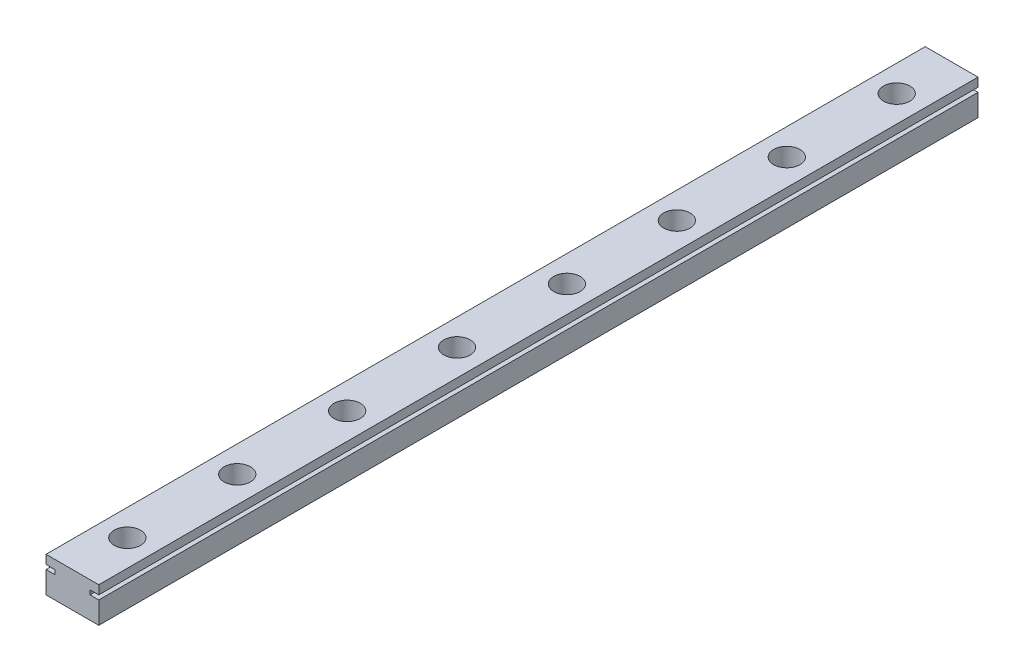
ISO-10303-21;
HEADER;
FILE_DESCRIPTION(('STEP AP214'),'2;1');
FILE_NAME('part.step','',(''),(''),'','','');
FILE_SCHEMA(('AUTOMOTIVE_DESIGN { 1 0 10303 214 1 1 1 1 }'));
ENDSEC;
DATA;
#1=APPLICATION_CONTEXT('core data for automotive mechanical design processes');
#2=APPLICATION_PROTOCOL_DEFINITION('international standard','automotive_design',2000,#1);
#3=PRODUCT_CONTEXT('',#1,'mechanical');
#4=PRODUCT('Part','Part','',(#3));
#5=PRODUCT_RELATED_PRODUCT_CATEGORY('part','',(#4));
#6=PRODUCT_DEFINITION_FORMATION('','',#4);
#7=PRODUCT_DEFINITION_CONTEXT('part definition',#1,'design');
#8=PRODUCT_DEFINITION('design','',#6,#7);
#9=PRODUCT_DEFINITION_SHAPE('','',#8);
#10=(LENGTH_UNIT() NAMED_UNIT(*) SI_UNIT(.MILLI.,.METRE.));
#11=(NAMED_UNIT(*) PLANE_ANGLE_UNIT() SI_UNIT($,.RADIAN.));
#12=(NAMED_UNIT(*) SI_UNIT($,.STERADIAN.) SOLID_ANGLE_UNIT());
#13=UNCERTAINTY_MEASURE_WITH_UNIT(LENGTH_MEASURE(1.E-05),#10,'distance_accuracy_value','');
#14=(GEOMETRIC_REPRESENTATION_CONTEXT(3) GLOBAL_UNCERTAINTY_ASSIGNED_CONTEXT((#13)) GLOBAL_UNIT_ASSIGNED_CONTEXT((#10,
#11,#12)) REPRESENTATION_CONTEXT('',''));
#15=CARTESIAN_POINT('',(0.,0.,0.));
#16=DIRECTION('',(0.,0.,1.));
#17=DIRECTION('',(1.,0.,0.));
#18=AXIS2_PLACEMENT_3D('',#15,#16,#17);
#19=CARTESIAN_POINT('',(-6.,4.,100.));
#20=DIRECTION('',(0.,-1.,0.));
#21=DIRECTION('',(0.,0.,-1.));
#22=AXIS2_PLACEMENT_3D('',#19,#20,#21);
#23=PLANE('',#22);
#24=CARTESIAN_POINT('',(0.,4.,-37.5));
#25=DIRECTION('',(0.,1.,0.));
#26=DIRECTION('',(0.,0.,1.));
#27=AXIS2_PLACEMENT_3D('',#24,#25,#26);
#28=CIRCLE('',#27,3.);
#29=CARTESIAN_POINT('',(0.,4.,-34.5));
#30=VERTEX_POINT('',#29);
#31=EDGE_CURVE('E305',#30,#30,#28,.T.);
#32=ORIENTED_EDGE('',*,*,#31,.F.);
#33=EDGE_LOOP('',(#32));
#34=FACE_BOUND('',#33,.T.);
#35=CARTESIAN_POINT('',(0.,4.,-62.5));
#36=DIRECTION('',(0.,1.,0.));
#37=DIRECTION('',(0.,0.,1.));
#38=AXIS2_PLACEMENT_3D('',#35,#36,#37);
#39=CIRCLE('',#38,3.);
#40=CARTESIAN_POINT('',(0.,4.,-59.5));
#41=VERTEX_POINT('',#40);
#42=EDGE_CURVE('E309',#41,#41,#39,.T.);
#43=ORIENTED_EDGE('',*,*,#42,.F.);
#44=EDGE_LOOP('',(#43));
#45=FACE_BOUND('',#44,.T.);
#46=CARTESIAN_POINT('',(0.,4.,-87.5));
#47=DIRECTION('',(0.,1.,0.));
#48=DIRECTION('',(0.,0.,1.));
#49=AXIS2_PLACEMENT_3D('',#46,#47,#48);
#50=CIRCLE('',#49,3.);
#51=CARTESIAN_POINT('',(0.,4.,-84.5));
#52=VERTEX_POINT('',#51);
#53=EDGE_CURVE('E313',#52,#52,#50,.T.);
#54=ORIENTED_EDGE('',*,*,#53,.F.);
#55=EDGE_LOOP('',(#54));
#56=FACE_BOUND('',#55,.T.);
#57=CARTESIAN_POINT('',(0.,4.,-12.5));
#58=DIRECTION('',(0.,1.,0.));
#59=DIRECTION('',(0.,0.,1.));
#60=AXIS2_PLACEMENT_3D('',#57,#58,#59);
#61=CIRCLE('',#60,3.);
#62=CARTESIAN_POINT('',(0.,4.,-9.5));
#63=VERTEX_POINT('',#62);
#64=EDGE_CURVE('E317',#63,#63,#61,.T.);
#65=ORIENTED_EDGE('',*,*,#64,.F.);
#66=EDGE_LOOP('',(#65));
#67=FACE_BOUND('',#66,.T.);
#68=CARTESIAN_POINT('',(0.,4.,12.5));
#69=DIRECTION('',(0.,1.,0.));
#70=DIRECTION('',(0.,0.,1.));
#71=AXIS2_PLACEMENT_3D('',#68,#69,#70);
#72=CIRCLE('',#71,3.);
#73=CARTESIAN_POINT('',(0.,4.,15.5));
#74=VERTEX_POINT('',#73);
#75=EDGE_CURVE('E321',#74,#74,#72,.T.);
#76=ORIENTED_EDGE('',*,*,#75,.F.);
#77=EDGE_LOOP('',(#76));
#78=FACE_BOUND('',#77,.T.);
#79=CARTESIAN_POINT('',(0.,4.,37.5));
#80=DIRECTION('',(0.,1.,0.));
#81=DIRECTION('',(0.,0.,1.));
#82=AXIS2_PLACEMENT_3D('',#79,#80,#81);
#83=CIRCLE('',#82,3.);
#84=CARTESIAN_POINT('',(0.,4.,40.5));
#85=VERTEX_POINT('',#84);
#86=EDGE_CURVE('E325',#85,#85,#83,.T.);
#87=ORIENTED_EDGE('',*,*,#86,.F.);
#88=EDGE_LOOP('',(#87));
#89=FACE_BOUND('',#88,.T.);
#90=CARTESIAN_POINT('',(0.,4.,62.5));
#91=DIRECTION('',(0.,1.,0.));
#92=DIRECTION('',(0.,0.,1.));
#93=AXIS2_PLACEMENT_3D('',#90,#91,#92);
#94=CIRCLE('',#93,3.);
#95=CARTESIAN_POINT('',(0.,4.,65.5));
#96=VERTEX_POINT('',#95);
#97=EDGE_CURVE('E329',#96,#96,#94,.T.);
#98=ORIENTED_EDGE('',*,*,#97,.F.);
#99=EDGE_LOOP('',(#98));
#100=FACE_BOUND('',#99,.T.);
#101=CARTESIAN_POINT('',(0.,4.,87.5));
#102=DIRECTION('',(0.,1.,0.));
#103=DIRECTION('',(0.,0.,1.));
#104=AXIS2_PLACEMENT_3D('',#101,#102,#103);
#105=CIRCLE('',#104,3.);
#106=CARTESIAN_POINT('',(0.,4.,90.5));
#107=VERTEX_POINT('',#106);
#108=EDGE_CURVE('E173',#107,#107,#105,.T.);
#109=ORIENTED_EDGE('',*,*,#108,.F.);
#110=EDGE_LOOP('',(#109));
#111=FACE_BOUND('',#110,.T.);
#112=DIRECTION('',(-1.,0.,0.));
#113=VECTOR('',#112,1.);
#114=CARTESIAN_POINT('',(-6.,4.,-100.));
#115=LINE('',#114,#113);
#116=CARTESIAN_POINT('',(6.,4.,-100.));
#117=VERTEX_POINT('',#116);
#118=CARTESIAN_POINT('',(-6.,4.,-100.));
#119=VERTEX_POINT('',#118);
#120=EDGE_CURVE('E168',#117,#119,#115,.T.);
#121=ORIENTED_EDGE('',*,*,#120,.T.);
#122=DIRECTION('',(0.,0.,-1.));
#123=VECTOR('',#122,1.);
#124=CARTESIAN_POINT('',(-6.,4.,100.));
#125=LINE('',#124,#123);
#126=CARTESIAN_POINT('',(-6.,4.,100.));
#127=VERTEX_POINT('',#126);
#128=EDGE_CURVE('E11',#127,#119,#125,.T.);
#129=ORIENTED_EDGE('',*,*,#128,.F.);
#130=DIRECTION('',(-1.,0.,0.));
#131=VECTOR('',#130,1.);
#132=CARTESIAN_POINT('',(-6.,4.,100.));
#133=LINE('',#132,#131);
#134=CARTESIAN_POINT('',(6.,4.,100.));
#135=VERTEX_POINT('',#134);
#136=EDGE_CURVE('E203',#135,#127,#133,.T.);
#137=ORIENTED_EDGE('',*,*,#136,.F.);
#138=DIRECTION('',(0.,0.,-1.));
#139=VECTOR('',#138,1.);
#140=CARTESIAN_POINT('',(6.,4.,100.));
#141=LINE('',#140,#139);
#142=EDGE_CURVE('E164',#135,#117,#141,.T.);
#143=ORIENTED_EDGE('',*,*,#142,.T.);
#144=EDGE_LOOP('',(#121,#129,#137,#143));
#145=FACE_BOUND('',#144,.T.);
#146=ADVANCED_FACE('F43',(#34,#45,#56,#67,#78,#89,#100,#111,#145),#23,.F.);
#147=CARTESIAN_POINT('',(-6.,2.,100.));
#148=DIRECTION('',(1.,0.,0.));
#149=DIRECTION('',(0.,0.,-1.));
#150=AXIS2_PLACEMENT_3D('',#147,#148,#149);
#151=PLANE('',#150);
#152=DIRECTION('',(0.,-1.,0.));
#153=VECTOR('',#152,1.);
#154=CARTESIAN_POINT('',(-6.,2.,-100.));
#155=LINE('',#154,#153);
#156=CARTESIAN_POINT('',(-6.,2.,-100.));
#157=VERTEX_POINT('',#156);
#158=EDGE_CURVE('E172',#119,#157,#155,.T.);
#159=ORIENTED_EDGE('',*,*,#158,.T.);
#160=DIRECTION('',(0.,0.,-1.));
#161=VECTOR('',#160,1.);
#162=CARTESIAN_POINT('',(-6.,2.,100.));
#163=LINE('',#162,#161);
#164=CARTESIAN_POINT('',(-6.,2.,100.));
#165=VERTEX_POINT('',#164);
#166=EDGE_CURVE('E52',#165,#157,#163,.T.);
#167=ORIENTED_EDGE('',*,*,#166,.F.);
#168=DIRECTION('',(0.,-1.,0.));
#169=VECTOR('',#168,1.);
#170=CARTESIAN_POINT('',(-6.,2.,100.));
#171=LINE('',#170,#169);
#172=EDGE_CURVE('E115',#127,#165,#171,.T.);
#173=ORIENTED_EDGE('',*,*,#172,.F.);
#174=ORIENTED_EDGE('',*,*,#128,.T.);
#175=EDGE_LOOP('',(#159,#167,#173,#174));
#176=FACE_BOUND('',#175,.T.);
#177=ADVANCED_FACE('F297',(#176),#151,.F.);
#178=CARTESIAN_POINT('',(-6.,2.,100.));
#179=DIRECTION('',(0.,1.,0.));
#180=DIRECTION('',(-1.,0.,0.));
#181=AXIS2_PLACEMENT_3D('',#178,#179,#180);
#182=PLANE('',#181);
#183=DIRECTION('',(1.,0.,0.));
#184=VECTOR('',#183,1.);
#185=CARTESIAN_POINT('',(-6.,2.,-100.));
#186=LINE('',#185,#184);
#187=CARTESIAN_POINT('',(-4.,2.,-100.));
#188=VERTEX_POINT('',#187);
#189=EDGE_CURVE('E176',#157,#188,#186,.T.);
#190=ORIENTED_EDGE('',*,*,#189,.T.);
#191=DIRECTION('',(0.,0.,-1.));
#192=VECTOR('',#191,1.);
#193=CARTESIAN_POINT('',(-4.,2.,100.));
#194=LINE('',#193,#192);
#195=CARTESIAN_POINT('',(-4.,2.,100.));
#196=VERTEX_POINT('',#195);
#197=EDGE_CURVE('E230',#196,#188,#194,.T.);
#198=ORIENTED_EDGE('',*,*,#197,.F.);
#199=DIRECTION('',(1.,0.,0.));
#200=VECTOR('',#199,1.);
#201=CARTESIAN_POINT('',(-6.,2.,100.));
#202=LINE('',#201,#200);
#203=EDGE_CURVE('E240',#165,#196,#202,.T.);
#204=ORIENTED_EDGE('',*,*,#203,.F.);
#205=ORIENTED_EDGE('',*,*,#166,.T.);
#206=EDGE_LOOP('',(#190,#198,#204,#205));
#207=FACE_BOUND('',#206,.T.);
#208=ADVANCED_FACE('F238',(#207),#182,.F.);
#209=CARTESIAN_POINT('',(-4.,1.,100.));
#210=DIRECTION('',(1.,0.,0.));
#211=DIRECTION('',(0.,0.,-1.));
#212=AXIS2_PLACEMENT_3D('',#209,#210,#211);
#213=PLANE('',#212);
#214=DIRECTION('',(0.,-1.,0.));
#215=VECTOR('',#214,1.);
#216=CARTESIAN_POINT('',(-4.,1.,-100.));
#217=LINE('',#216,#215);
#218=CARTESIAN_POINT('',(-4.,1.,-100.));
#219=VERTEX_POINT('',#218);
#220=EDGE_CURVE('E179',#188,#219,#217,.T.);
#221=ORIENTED_EDGE('',*,*,#220,.T.);
#222=DIRECTION('',(0.,0.,-1.));
#223=VECTOR('',#222,1.);
#224=CARTESIAN_POINT('',(-4.,1.,100.));
#225=LINE('',#224,#223);
#226=CARTESIAN_POINT('',(-4.,1.,100.));
#227=VERTEX_POINT('',#226);
#228=EDGE_CURVE('E226',#227,#219,#225,.T.);
#229=ORIENTED_EDGE('',*,*,#228,.F.);
#230=DIRECTION('',(0.,-1.,0.));
#231=VECTOR('',#230,1.);
#232=CARTESIAN_POINT('',(-4.,1.,100.));
#233=LINE('',#232,#231);
#234=EDGE_CURVE('E259',#196,#227,#233,.T.);
#235=ORIENTED_EDGE('',*,*,#234,.F.);
#236=ORIENTED_EDGE('',*,*,#197,.T.);
#237=EDGE_LOOP('',(#221,#229,#235,#236));
#238=FACE_BOUND('',#237,.T.);
#239=ADVANCED_FACE('F249',(#238),#213,.F.);
#240=CARTESIAN_POINT('',(-6.,1.,100.));
#241=DIRECTION('',(0.,-1.,0.));
#242=DIRECTION('',(1.,0.,0.));
#243=AXIS2_PLACEMENT_3D('',#240,#241,#242);
#244=PLANE('',#243);
#245=DIRECTION('',(-1.,0.,0.));
#246=VECTOR('',#245,1.);
#247=CARTESIAN_POINT('',(-6.,1.,-100.));
#248=LINE('',#247,#246);
#249=CARTESIAN_POINT('',(-6.,1.,-100.));
#250=VERTEX_POINT('',#249);
#251=EDGE_CURVE('E182',#219,#250,#248,.T.);
#252=ORIENTED_EDGE('',*,*,#251,.T.);
#253=DIRECTION('',(0.,0.,-1.));
#254=VECTOR('',#253,1.);
#255=CARTESIAN_POINT('',(-6.,1.,100.));
#256=LINE('',#255,#254);
#257=CARTESIAN_POINT('',(-6.,1.,100.));
#258=VERTEX_POINT('',#257);
#259=EDGE_CURVE('E222',#258,#250,#256,.T.);
#260=ORIENTED_EDGE('',*,*,#259,.F.);
#261=DIRECTION('',(-1.,0.,0.));
#262=VECTOR('',#261,1.);
#263=CARTESIAN_POINT('',(-6.,1.,100.));
#264=LINE('',#263,#262);
#265=EDGE_CURVE('E255',#227,#258,#264,.T.);
#266=ORIENTED_EDGE('',*,*,#265,.F.);
#267=ORIENTED_EDGE('',*,*,#228,.T.);
#268=EDGE_LOOP('',(#252,#260,#266,#267));
#269=FACE_BOUND('',#268,.T.);
#270=ADVANCED_FACE('F253',(#269),#244,.F.);
#271=CARTESIAN_POINT('',(-6.,-4.,100.));
#272=DIRECTION('',(1.,0.,0.));
#273=DIRECTION('',(0.,0.,-1.));
#274=AXIS2_PLACEMENT_3D('',#271,#272,#273);
#275=PLANE('',#274);
#276=DIRECTION('',(0.,-1.,0.));
#277=VECTOR('',#276,1.);
#278=CARTESIAN_POINT('',(-6.,-4.,-100.));
#279=LINE('',#278,#277);
#280=CARTESIAN_POINT('',(-6.,-4.,-100.));
#281=VERTEX_POINT('',#280);
#282=EDGE_CURVE('E185',#250,#281,#279,.T.);
#283=ORIENTED_EDGE('',*,*,#282,.T.);
#284=DIRECTION('',(0.,0.,-1.));
#285=VECTOR('',#284,1.);
#286=CARTESIAN_POINT('',(-6.,-4.,100.));
#287=LINE('',#286,#285);
#288=CARTESIAN_POINT('',(-6.,-4.,100.));
#289=VERTEX_POINT('',#288);
#290=EDGE_CURVE('E218',#289,#281,#287,.T.);
#291=ORIENTED_EDGE('',*,*,#290,.F.);
#292=DIRECTION('',(0.,-1.,0.));
#293=VECTOR('',#292,1.);
#294=CARTESIAN_POINT('',(-6.,-4.,100.));
#295=LINE('',#294,#293);
#296=EDGE_CURVE('E258',#258,#289,#295,.T.);
#297=ORIENTED_EDGE('',*,*,#296,.F.);
#298=ORIENTED_EDGE('',*,*,#259,.T.);
#299=EDGE_LOOP('',(#283,#291,#297,#298));
#300=FACE_BOUND('',#299,.T.);
#301=ADVANCED_FACE('F804',(#300),#275,.F.);
#302=CARTESIAN_POINT('',(-6.,-4.,100.));
#303=DIRECTION('',(0.,1.,0.));
#304=DIRECTION('',(0.,0.,1.));
#305=AXIS2_PLACEMENT_3D('',#302,#303,#304);
#306=PLANE('',#305);
#307=CARTESIAN_POINT('',(0.,-4.,-37.5));
#308=DIRECTION('',(0.,1.,0.));
#309=DIRECTION('',(0.,0.,1.));
#310=AXIS2_PLACEMENT_3D('',#307,#308,#309);
#311=CIRCLE('',#310,1.7);
#312=CARTESIAN_POINT('',(0.,-4.,-35.8));
#313=VERTEX_POINT('',#312);
#314=EDGE_CURVE('E447',#313,#313,#311,.T.);
#315=ORIENTED_EDGE('',*,*,#314,.T.);
#316=EDGE_LOOP('',(#315));
#317=FACE_BOUND('',#316,.T.);
#318=CARTESIAN_POINT('',(0.,-4.,-62.5));
#319=DIRECTION('',(0.,1.,0.));
#320=DIRECTION('',(0.,0.,1.));
#321=AXIS2_PLACEMENT_3D('',#318,#319,#320);
#322=CIRCLE('',#321,1.7);
#323=CARTESIAN_POINT('',(0.,-4.,-60.8));
#324=VERTEX_POINT('',#323);
#325=EDGE_CURVE('E433',#324,#324,#322,.T.);
#326=ORIENTED_EDGE('',*,*,#325,.T.);
#327=EDGE_LOOP('',(#326));
#328=FACE_BOUND('',#327,.T.);
#329=CARTESIAN_POINT('',(0.,-4.,-87.5));
#330=DIRECTION('',(0.,1.,0.));
#331=DIRECTION('',(0.,0.,1.));
#332=AXIS2_PLACEMENT_3D('',#329,#330,#331);
#333=CIRCLE('',#332,1.7);
#334=CARTESIAN_POINT('',(0.,-4.,-85.8));
#335=VERTEX_POINT('',#334);
#336=EDGE_CURVE('E419',#335,#335,#333,.T.);
#337=ORIENTED_EDGE('',*,*,#336,.T.);
#338=EDGE_LOOP('',(#337));
#339=FACE_BOUND('',#338,.T.);
#340=CARTESIAN_POINT('',(0.,-4.,-12.5));
#341=DIRECTION('',(0.,1.,0.));
#342=DIRECTION('',(0.,0.,1.));
#343=AXIS2_PLACEMENT_3D('',#340,#341,#342);
#344=CIRCLE('',#343,1.7);
#345=CARTESIAN_POINT('',(0.,-4.,-10.8));
#346=VERTEX_POINT('',#345);
#347=EDGE_CURVE('E405',#346,#346,#344,.T.);
#348=ORIENTED_EDGE('',*,*,#347,.T.);
#349=EDGE_LOOP('',(#348));
#350=FACE_BOUND('',#349,.T.);
#351=CARTESIAN_POINT('',(0.,-4.,12.5));
#352=DIRECTION('',(0.,1.,0.));
#353=DIRECTION('',(0.,0.,1.));
#354=AXIS2_PLACEMENT_3D('',#351,#352,#353);
#355=CIRCLE('',#354,1.7);
#356=CARTESIAN_POINT('',(0.,-4.,14.2));
#357=VERTEX_POINT('',#356);
#358=EDGE_CURVE('E391',#357,#357,#355,.T.);
#359=ORIENTED_EDGE('',*,*,#358,.T.);
#360=EDGE_LOOP('',(#359));
#361=FACE_BOUND('',#360,.T.);
#362=CARTESIAN_POINT('',(0.,-4.,37.5));
#363=DIRECTION('',(0.,1.,0.));
#364=DIRECTION('',(0.,0.,1.));
#365=AXIS2_PLACEMENT_3D('',#362,#363,#364);
#366=CIRCLE('',#365,1.7);
#367=CARTESIAN_POINT('',(0.,-4.,39.2));
#368=VERTEX_POINT('',#367);
#369=EDGE_CURVE('E377',#368,#368,#366,.T.);
#370=ORIENTED_EDGE('',*,*,#369,.T.);
#371=EDGE_LOOP('',(#370));
#372=FACE_BOUND('',#371,.T.);
#373=CARTESIAN_POINT('',(0.,-4.,62.5));
#374=DIRECTION('',(0.,1.,0.));
#375=DIRECTION('',(0.,0.,1.));
#376=AXIS2_PLACEMENT_3D('',#373,#374,#375);
#377=CIRCLE('',#376,1.7);
#378=CARTESIAN_POINT('',(0.,-4.,64.2));
#379=VERTEX_POINT('',#378);
#380=EDGE_CURVE('E363',#379,#379,#377,.T.);
#381=ORIENTED_EDGE('',*,*,#380,.T.);
#382=EDGE_LOOP('',(#381));
#383=FACE_BOUND('',#382,.T.);
#384=CARTESIAN_POINT('',(0.,-4.,87.5));
#385=DIRECTION('',(0.,1.,0.));
#386=DIRECTION('',(0.,0.,1.));
#387=AXIS2_PLACEMENT_3D('',#384,#385,#386);
#388=CIRCLE('',#387,1.7);
#389=CARTESIAN_POINT('',(0.,-4.,89.2));
#390=VERTEX_POINT('',#389);
#391=EDGE_CURVE('E349',#390,#390,#388,.T.);
#392=ORIENTED_EDGE('',*,*,#391,.T.);
#393=EDGE_LOOP('',(#392));
#394=FACE_BOUND('',#393,.T.);
#395=DIRECTION('',(1.,0.,0.));
#396=VECTOR('',#395,1.);
#397=CARTESIAN_POINT('',(-6.,-4.,-100.));
#398=LINE('',#397,#396);
#399=CARTESIAN_POINT('',(6.,-4.,-100.));
#400=VERTEX_POINT('',#399);
#401=EDGE_CURVE('E188',#281,#400,#398,.T.);
#402=ORIENTED_EDGE('',*,*,#401,.T.);
#403=DIRECTION('',(0.,0.,-1.));
#404=VECTOR('',#403,1.);
#405=CARTESIAN_POINT('',(6.,-4.,100.));
#406=LINE('',#405,#404);
#407=CARTESIAN_POINT('',(6.,-4.,100.));
#408=VERTEX_POINT('',#407);
#409=EDGE_CURVE('E214',#408,#400,#406,.T.);
#410=ORIENTED_EDGE('',*,*,#409,.F.);
#411=DIRECTION('',(1.,0.,0.));
#412=VECTOR('',#411,1.);
#413=CARTESIAN_POINT('',(-6.,-4.,100.));
#414=LINE('',#413,#412);
#415=EDGE_CURVE('E263',#289,#408,#414,.T.);
#416=ORIENTED_EDGE('',*,*,#415,.F.);
#417=ORIENTED_EDGE('',*,*,#290,.T.);
#418=EDGE_LOOP('',(#402,#410,#416,#417));
#419=FACE_BOUND('',#418,.T.);
#420=ADVANCED_FACE('F452',(#317,#328,#339,#350,#361,#372,#383,#394,#419),#306,.F.);
#421=CARTESIAN_POINT('',(6.,-4.,100.));
#422=DIRECTION('',(-1.,0.,0.));
#423=DIRECTION('',(0.,-1.,0.));
#424=AXIS2_PLACEMENT_3D('',#421,#422,#423);
#425=PLANE('',#424);
#426=DIRECTION('',(0.,1.,0.));
#427=VECTOR('',#426,1.);
#428=CARTESIAN_POINT('',(6.,-4.,-100.));
#429=LINE('',#428,#427);
#430=CARTESIAN_POINT('',(6.,1.,-100.));
#431=VERTEX_POINT('',#430);
#432=EDGE_CURVE('E191',#400,#431,#429,.T.);
#433=ORIENTED_EDGE('',*,*,#432,.T.);
#434=DIRECTION('',(0.,0.,-1.));
#435=VECTOR('',#434,1.);
#436=CARTESIAN_POINT('',(6.,1.,100.));
#437=LINE('',#436,#435);
#438=CARTESIAN_POINT('',(6.,1.,100.));
#439=VERTEX_POINT('',#438);
#440=EDGE_CURVE('E210',#439,#431,#437,.T.);
#441=ORIENTED_EDGE('',*,*,#440,.F.);
#442=DIRECTION('',(0.,1.,0.));
#443=VECTOR('',#442,1.);
#444=CARTESIAN_POINT('',(6.,-4.,100.));
#445=LINE('',#444,#443);
#446=EDGE_CURVE('E270',#408,#439,#445,.T.);
#447=ORIENTED_EDGE('',*,*,#446,.F.);
#448=ORIENTED_EDGE('',*,*,#409,.T.);
#449=EDGE_LOOP('',(#433,#441,#447,#448));
#450=FACE_BOUND('',#449,.T.);
#451=ADVANCED_FACE('F278',(#450),#425,.F.);
#452=CARTESIAN_POINT('',(6.,1.,100.));
#453=DIRECTION('',(0.,-1.,0.));
#454=DIRECTION('',(1.,0.,0.));
#455=AXIS2_PLACEMENT_3D('',#452,#453,#454);
#456=PLANE('',#455);
#457=DIRECTION('',(-1.,0.,0.));
#458=VECTOR('',#457,1.);
#459=CARTESIAN_POINT('',(6.,1.,-100.));
#460=LINE('',#459,#458);
#461=CARTESIAN_POINT('',(4.,1.,-100.));
#462=VERTEX_POINT('',#461);
#463=EDGE_CURVE('E194',#431,#462,#460,.T.);
#464=ORIENTED_EDGE('',*,*,#463,.T.);
#465=DIRECTION('',(0.,0.,-1.));
#466=VECTOR('',#465,1.);
#467=CARTESIAN_POINT('',(4.,1.,100.));
#468=LINE('',#467,#466);
#469=CARTESIAN_POINT('',(4.,1.,100.));
#470=VERTEX_POINT('',#469);
#471=EDGE_CURVE('E157',#470,#462,#468,.T.);
#472=ORIENTED_EDGE('',*,*,#471,.F.);
#473=DIRECTION('',(-1.,0.,0.));
#474=VECTOR('',#473,1.);
#475=CARTESIAN_POINT('',(6.,1.,100.));
#476=LINE('',#475,#474);
#477=EDGE_CURVE('E146',#439,#470,#476,.T.);
#478=ORIENTED_EDGE('',*,*,#477,.F.);
#479=ORIENTED_EDGE('',*,*,#440,.T.);
#480=EDGE_LOOP('',(#464,#472,#478,#479));
#481=FACE_BOUND('',#480,.T.);
#482=ADVANCED_FACE('F282',(#481),#456,.F.);
#483=CARTESIAN_POINT('',(4.,1.,100.));
#484=DIRECTION('',(-1.,0.,0.));
#485=DIRECTION('',(0.,0.,1.));
#486=AXIS2_PLACEMENT_3D('',#483,#484,#485);
#487=PLANE('',#486);
#488=DIRECTION('',(0.,1.,0.));
#489=VECTOR('',#488,1.);
#490=CARTESIAN_POINT('',(4.,1.,-100.));
#491=LINE('',#490,#489);
#492=CARTESIAN_POINT('',(4.,2.,-100.));
#493=VERTEX_POINT('',#492);
#494=EDGE_CURVE('E155',#462,#493,#491,.T.);
#495=ORIENTED_EDGE('',*,*,#494,.T.);
#496=DIRECTION('',(0.,0.,-1.));
#497=VECTOR('',#496,1.);
#498=CARTESIAN_POINT('',(4.,2.,100.));
#499=LINE('',#498,#497);
#500=CARTESIAN_POINT('',(4.,2.,100.));
#501=VERTEX_POINT('',#500);
#502=EDGE_CURVE('E152',#501,#493,#499,.T.);
#503=ORIENTED_EDGE('',*,*,#502,.F.);
#504=DIRECTION('',(0.,1.,0.));
#505=VECTOR('',#504,1.);
#506=CARTESIAN_POINT('',(4.,1.,100.));
#507=LINE('',#506,#505);
#508=EDGE_CURVE('E140',#470,#501,#507,.T.);
#509=ORIENTED_EDGE('',*,*,#508,.F.);
#510=ORIENTED_EDGE('',*,*,#471,.T.);
#511=EDGE_LOOP('',(#495,#503,#509,#510));
#512=FACE_BOUND('',#511,.T.);
#513=ADVANCED_FACE('F153',(#512),#487,.F.);
#514=CARTESIAN_POINT('',(6.,2.,100.));
#515=DIRECTION('',(0.,1.,0.));
#516=DIRECTION('',(-1.,0.,0.));
#517=AXIS2_PLACEMENT_3D('',#514,#515,#516);
#518=PLANE('',#517);
#519=DIRECTION('',(1.,0.,0.));
#520=VECTOR('',#519,1.);
#521=CARTESIAN_POINT('',(6.,2.,-100.));
#522=LINE('',#521,#520);
#523=CARTESIAN_POINT('',(6.,2.,-100.));
#524=VERTEX_POINT('',#523);
#525=EDGE_CURVE('E101',#493,#524,#522,.T.);
#526=ORIENTED_EDGE('',*,*,#525,.T.);
#527=DIRECTION('',(0.,0.,-1.));
#528=VECTOR('',#527,1.);
#529=CARTESIAN_POINT('',(6.,2.,100.));
#530=LINE('',#529,#528);
#531=CARTESIAN_POINT('',(6.,2.,100.));
#532=VERTEX_POINT('',#531);
#533=EDGE_CURVE('E158',#532,#524,#530,.T.);
#534=ORIENTED_EDGE('',*,*,#533,.F.);
#535=DIRECTION('',(1.,0.,0.));
#536=VECTOR('',#535,1.);
#537=CARTESIAN_POINT('',(6.,2.,100.));
#538=LINE('',#537,#536);
#539=EDGE_CURVE('E144',#501,#532,#538,.T.);
#540=ORIENTED_EDGE('',*,*,#539,.F.);
#541=ORIENTED_EDGE('',*,*,#502,.T.);
#542=EDGE_LOOP('',(#526,#534,#540,#541));
#543=FACE_BOUND('',#542,.T.);
#544=ADVANCED_FACE('F160',(#543),#518,.F.);
#545=CARTESIAN_POINT('',(6.,2.,100.));
#546=DIRECTION('',(-1.,0.,0.));
#547=DIRECTION('',(0.,-1.,0.));
#548=AXIS2_PLACEMENT_3D('',#545,#546,#547);
#549=PLANE('',#548);
#550=DIRECTION('',(0.,1.,0.));
#551=VECTOR('',#550,1.);
#552=CARTESIAN_POINT('',(6.,2.,-100.));
#553=LINE('',#552,#551);
#554=EDGE_CURVE('E107',#524,#117,#553,.T.);
#555=ORIENTED_EDGE('',*,*,#554,.T.);
#556=ORIENTED_EDGE('',*,*,#142,.F.);
#557=DIRECTION('',(0.,1.,0.));
#558=VECTOR('',#557,1.);
#559=CARTESIAN_POINT('',(6.,2.,100.));
#560=LINE('',#559,#558);
#561=EDGE_CURVE('E60',#532,#135,#560,.T.);
#562=ORIENTED_EDGE('',*,*,#561,.F.);
#563=ORIENTED_EDGE('',*,*,#533,.T.);
#564=EDGE_LOOP('',(#555,#556,#562,#563));
#565=FACE_BOUND('',#564,.T.);
#566=ADVANCED_FACE('F286',(#565),#549,.F.);
#567=CARTESIAN_POINT('',(0.,0.,100.));
#568=DIRECTION('',(0.,0.,1.));
#569=DIRECTION('',(1.,0.,0.));
#570=AXIS2_PLACEMENT_3D('',#567,#568,#569);
#571=PLANE('',#570);
#572=ORIENTED_EDGE('',*,*,#136,.T.);
#573=ORIENTED_EDGE('',*,*,#172,.T.);
#574=ORIENTED_EDGE('',*,*,#203,.T.);
#575=ORIENTED_EDGE('',*,*,#234,.T.);
#576=ORIENTED_EDGE('',*,*,#265,.T.);
#577=ORIENTED_EDGE('',*,*,#296,.T.);
#578=ORIENTED_EDGE('',*,*,#415,.T.);
#579=ORIENTED_EDGE('',*,*,#446,.T.);
#580=ORIENTED_EDGE('',*,*,#477,.T.);
#581=ORIENTED_EDGE('',*,*,#508,.T.);
#582=ORIENTED_EDGE('',*,*,#539,.T.);
#583=ORIENTED_EDGE('',*,*,#561,.T.);
#584=EDGE_LOOP('',(#572,#573,#574,#575,#576,#577,#578,#579,#580,#581,#582,#583));
#585=FACE_BOUND('',#584,.T.);
#586=ADVANCED_FACE('F142',(#585),#571,.T.);
#587=CARTESIAN_POINT('',(0.,0.,-100.));
#588=DIRECTION('',(0.,0.,1.));
#589=DIRECTION('',(1.,0.,0.));
#590=AXIS2_PLACEMENT_3D('',#587,#588,#589);
#591=PLANE('',#590);
#592=ORIENTED_EDGE('',*,*,#120,.F.);
#593=ORIENTED_EDGE('',*,*,#554,.F.);
#594=ORIENTED_EDGE('',*,*,#525,.F.);
#595=ORIENTED_EDGE('',*,*,#494,.F.);
#596=ORIENTED_EDGE('',*,*,#463,.F.);
#597=ORIENTED_EDGE('',*,*,#432,.F.);
#598=ORIENTED_EDGE('',*,*,#401,.F.);
#599=ORIENTED_EDGE('',*,*,#282,.F.);
#600=ORIENTED_EDGE('',*,*,#251,.F.);
#601=ORIENTED_EDGE('',*,*,#220,.F.);
#602=ORIENTED_EDGE('',*,*,#189,.F.);
#603=ORIENTED_EDGE('',*,*,#158,.F.);
#604=EDGE_LOOP('',(#592,#593,#594,#595,#596,#597,#598,#599,#600,#601,#602,#603));
#605=FACE_BOUND('',#604,.T.);
#606=ADVANCED_FACE('F244',(#605),#591,.F.);
#607=CARTESIAN_POINT('',(0.,4.,87.5));
#608=DIRECTION('',(0.,1.,0.));
#609=DIRECTION('',(0.,0.,1.));
#610=AXIS2_PLACEMENT_3D('',#607,#608,#609);
#611=CYLINDRICAL_SURFACE('',#610,3.);
#612=CARTESIAN_POINT('',(0.,-1.,87.5));
#613=DIRECTION('',(0.,1.,0.));
#614=DIRECTION('',(0.,0.,1.));
#615=AXIS2_PLACEMENT_3D('',#612,#613,#614);
#616=CIRCLE('',#615,3.);
#617=CARTESIAN_POINT('',(0.,-1.,90.5));
#618=VERTEX_POINT('',#617);
#619=EDGE_CURVE('E334',#618,#618,#616,.T.);
#620=ORIENTED_EDGE('',*,*,#619,.F.);
#621=EDGE_LOOP('',(#620));
#622=FACE_BOUND('',#621,.T.);
#623=ORIENTED_EDGE('',*,*,#108,.T.);
#624=EDGE_LOOP('',(#623));
#625=FACE_BOUND('',#624,.T.);
#626=ADVANCED_FACE('F553',(#622,#625),#611,.F.);
#627=CARTESIAN_POINT('',(3.,-1.,87.5));
#628=DIRECTION('',(0.,-1.,0.));
#629=DIRECTION('',(0.,0.,-1.));
#630=AXIS2_PLACEMENT_3D('',#627,#628,#629);
#631=PLANE('',#630);
#632=CARTESIAN_POINT('',(0.,-1.,87.5));
#633=DIRECTION('',(0.,1.,0.));
#634=DIRECTION('',(0.,0.,1.));
#635=AXIS2_PLACEMENT_3D('',#632,#633,#634);
#636=CIRCLE('',#635,1.7);
#637=CARTESIAN_POINT('',(0.,-1.,89.2));
#638=VERTEX_POINT('',#637);
#639=EDGE_CURVE('E338',#638,#638,#636,.T.);
#640=ORIENTED_EDGE('',*,*,#639,.F.);
#641=EDGE_LOOP('',(#640));
#642=FACE_BOUND('',#641,.T.);
#643=ORIENTED_EDGE('',*,*,#619,.T.);
#644=EDGE_LOOP('',(#643));
#645=FACE_BOUND('',#644,.T.);
#646=ADVANCED_FACE('F549',(#642,#645),#631,.F.);
#647=CARTESIAN_POINT('',(0.,4.,87.5));
#648=DIRECTION('',(0.,1.,0.));
#649=DIRECTION('',(0.,0.,1.));
#650=AXIS2_PLACEMENT_3D('',#647,#648,#649);
#651=CYLINDRICAL_SURFACE('',#650,1.7);
#652=ORIENTED_EDGE('',*,*,#391,.F.);
#653=EDGE_LOOP('',(#652));
#654=FACE_BOUND('',#653,.T.);
#655=ORIENTED_EDGE('',*,*,#639,.T.);
#656=EDGE_LOOP('',(#655));
#657=FACE_BOUND('',#656,.T.);
#658=ADVANCED_FACE('F545',(#654,#657),#651,.F.);
#659=CARTESIAN_POINT('',(0.,4.,62.5));
#660=DIRECTION('',(0.,1.,0.));
#661=DIRECTION('',(0.,0.,1.));
#662=AXIS2_PLACEMENT_3D('',#659,#660,#661);
#663=CYLINDRICAL_SURFACE('',#662,3.);
#664=CARTESIAN_POINT('',(0.,-1.,62.5));
#665=DIRECTION('',(0.,1.,0.));
#666=DIRECTION('',(0.,0.,1.));
#667=AXIS2_PLACEMENT_3D('',#664,#665,#666);
#668=CIRCLE('',#667,3.);
#669=CARTESIAN_POINT('',(0.,-1.,65.5));
#670=VERTEX_POINT('',#669);
#671=EDGE_CURVE('E355',#670,#670,#668,.T.);
#672=ORIENTED_EDGE('',*,*,#671,.F.);
#673=EDGE_LOOP('',(#672));
#674=FACE_BOUND('',#673,.T.);
#675=ORIENTED_EDGE('',*,*,#97,.T.);
#676=EDGE_LOOP('',(#675));
#677=FACE_BOUND('',#676,.T.);
#678=ADVANCED_FACE('F541',(#674,#677),#663,.F.);
#679=CARTESIAN_POINT('',(3.,-1.,62.5));
#680=DIRECTION('',(0.,-1.,0.));
#681=DIRECTION('',(0.,0.,-1.));
#682=AXIS2_PLACEMENT_3D('',#679,#680,#681);
#683=PLANE('',#682);
#684=CARTESIAN_POINT('',(0.,-1.,62.5));
#685=DIRECTION('',(0.,1.,0.));
#686=DIRECTION('',(0.,0.,1.));
#687=AXIS2_PLACEMENT_3D('',#684,#685,#686);
#688=CIRCLE('',#687,1.7);
#689=CARTESIAN_POINT('',(0.,-1.,64.2));
#690=VERTEX_POINT('',#689);
#691=EDGE_CURVE('E359',#690,#690,#688,.T.);
#692=ORIENTED_EDGE('',*,*,#691,.F.);
#693=EDGE_LOOP('',(#692));
#694=FACE_BOUND('',#693,.T.);
#695=ORIENTED_EDGE('',*,*,#671,.T.);
#696=EDGE_LOOP('',(#695));
#697=FACE_BOUND('',#696,.T.);
#698=ADVANCED_FACE('F537',(#694,#697),#683,.F.);
#699=CARTESIAN_POINT('',(0.,4.,62.5));
#700=DIRECTION('',(0.,1.,0.));
#701=DIRECTION('',(0.,0.,1.));
#702=AXIS2_PLACEMENT_3D('',#699,#700,#701);
#703=CYLINDRICAL_SURFACE('',#702,1.7);
#704=ORIENTED_EDGE('',*,*,#380,.F.);
#705=EDGE_LOOP('',(#704));
#706=FACE_BOUND('',#705,.T.);
#707=ORIENTED_EDGE('',*,*,#691,.T.);
#708=EDGE_LOOP('',(#707));
#709=FACE_BOUND('',#708,.T.);
#710=ADVANCED_FACE('F533',(#706,#709),#703,.F.);
#711=CARTESIAN_POINT('',(0.,4.,37.5));
#712=DIRECTION('',(0.,1.,0.));
#713=DIRECTION('',(0.,0.,1.));
#714=AXIS2_PLACEMENT_3D('',#711,#712,#713);
#715=CYLINDRICAL_SURFACE('',#714,3.);
#716=CARTESIAN_POINT('',(0.,-1.,37.5));
#717=DIRECTION('',(0.,1.,0.));
#718=DIRECTION('',(0.,0.,1.));
#719=AXIS2_PLACEMENT_3D('',#716,#717,#718);
#720=CIRCLE('',#719,3.);
#721=CARTESIAN_POINT('',(0.,-1.,40.5));
#722=VERTEX_POINT('',#721);
#723=EDGE_CURVE('E369',#722,#722,#720,.T.);
#724=ORIENTED_EDGE('',*,*,#723,.F.);
#725=EDGE_LOOP('',(#724));
#726=FACE_BOUND('',#725,.T.);
#727=ORIENTED_EDGE('',*,*,#86,.T.);
#728=EDGE_LOOP('',(#727));
#729=FACE_BOUND('',#728,.T.);
#730=ADVANCED_FACE('F529',(#726,#729),#715,.F.);
#731=CARTESIAN_POINT('',(3.,-1.,37.5));
#732=DIRECTION('',(0.,-1.,0.));
#733=DIRECTION('',(0.,0.,-1.));
#734=AXIS2_PLACEMENT_3D('',#731,#732,#733);
#735=PLANE('',#734);
#736=CARTESIAN_POINT('',(0.,-1.,37.5));
#737=DIRECTION('',(0.,1.,0.));
#738=DIRECTION('',(0.,0.,1.));
#739=AXIS2_PLACEMENT_3D('',#736,#737,#738);
#740=CIRCLE('',#739,1.7);
#741=CARTESIAN_POINT('',(0.,-1.,39.2));
#742=VERTEX_POINT('',#741);
#743=EDGE_CURVE('E373',#742,#742,#740,.T.);
#744=ORIENTED_EDGE('',*,*,#743,.F.);
#745=EDGE_LOOP('',(#744));
#746=FACE_BOUND('',#745,.T.);
#747=ORIENTED_EDGE('',*,*,#723,.T.);
#748=EDGE_LOOP('',(#747));
#749=FACE_BOUND('',#748,.T.);
#750=ADVANCED_FACE('F525',(#746,#749),#735,.F.);
#751=CARTESIAN_POINT('',(0.,4.,37.5));
#752=DIRECTION('',(0.,1.,0.));
#753=DIRECTION('',(0.,0.,1.));
#754=AXIS2_PLACEMENT_3D('',#751,#752,#753);
#755=CYLINDRICAL_SURFACE('',#754,1.7);
#756=ORIENTED_EDGE('',*,*,#369,.F.);
#757=EDGE_LOOP('',(#756));
#758=FACE_BOUND('',#757,.T.);
#759=ORIENTED_EDGE('',*,*,#743,.T.);
#760=EDGE_LOOP('',(#759));
#761=FACE_BOUND('',#760,.T.);
#762=ADVANCED_FACE('F521',(#758,#761),#755,.F.);
#763=CARTESIAN_POINT('',(0.,4.,12.5));
#764=DIRECTION('',(0.,1.,0.));
#765=DIRECTION('',(0.,0.,1.));
#766=AXIS2_PLACEMENT_3D('',#763,#764,#765);
#767=CYLINDRICAL_SURFACE('',#766,3.);
#768=CARTESIAN_POINT('',(0.,-1.,12.5));
#769=DIRECTION('',(0.,1.,0.));
#770=DIRECTION('',(0.,0.,1.));
#771=AXIS2_PLACEMENT_3D('',#768,#769,#770);
#772=CIRCLE('',#771,3.);
#773=CARTESIAN_POINT('',(0.,-1.,15.5));
#774=VERTEX_POINT('',#773);
#775=EDGE_CURVE('E383',#774,#774,#772,.T.);
#776=ORIENTED_EDGE('',*,*,#775,.F.);
#777=EDGE_LOOP('',(#776));
#778=FACE_BOUND('',#777,.T.);
#779=ORIENTED_EDGE('',*,*,#75,.T.);
#780=EDGE_LOOP('',(#779));
#781=FACE_BOUND('',#780,.T.);
#782=ADVANCED_FACE('F517',(#778,#781),#767,.F.);
#783=CARTESIAN_POINT('',(3.,-1.,12.5));
#784=DIRECTION('',(0.,-1.,0.));
#785=DIRECTION('',(0.,0.,-1.));
#786=AXIS2_PLACEMENT_3D('',#783,#784,#785);
#787=PLANE('',#786);
#788=CARTESIAN_POINT('',(0.,-1.,12.5));
#789=DIRECTION('',(0.,1.,0.));
#790=DIRECTION('',(0.,0.,1.));
#791=AXIS2_PLACEMENT_3D('',#788,#789,#790);
#792=CIRCLE('',#791,1.7);
#793=CARTESIAN_POINT('',(0.,-1.,14.2));
#794=VERTEX_POINT('',#793);
#795=EDGE_CURVE('E387',#794,#794,#792,.T.);
#796=ORIENTED_EDGE('',*,*,#795,.F.);
#797=EDGE_LOOP('',(#796));
#798=FACE_BOUND('',#797,.T.);
#799=ORIENTED_EDGE('',*,*,#775,.T.);
#800=EDGE_LOOP('',(#799));
#801=FACE_BOUND('',#800,.T.);
#802=ADVANCED_FACE('F513',(#798,#801),#787,.F.);
#803=CARTESIAN_POINT('',(0.,4.,12.5));
#804=DIRECTION('',(0.,1.,0.));
#805=DIRECTION('',(0.,0.,1.));
#806=AXIS2_PLACEMENT_3D('',#803,#804,#805);
#807=CYLINDRICAL_SURFACE('',#806,1.7);
#808=ORIENTED_EDGE('',*,*,#358,.F.);
#809=EDGE_LOOP('',(#808));
#810=FACE_BOUND('',#809,.T.);
#811=ORIENTED_EDGE('',*,*,#795,.T.);
#812=EDGE_LOOP('',(#811));
#813=FACE_BOUND('',#812,.T.);
#814=ADVANCED_FACE('F509',(#810,#813),#807,.F.);
#815=CARTESIAN_POINT('',(0.,4.,-12.5));
#816=DIRECTION('',(0.,1.,0.));
#817=DIRECTION('',(0.,0.,1.));
#818=AXIS2_PLACEMENT_3D('',#815,#816,#817);
#819=CYLINDRICAL_SURFACE('',#818,3.);
#820=CARTESIAN_POINT('',(0.,-1.,-12.5));
#821=DIRECTION('',(0.,1.,0.));
#822=DIRECTION('',(0.,0.,1.));
#823=AXIS2_PLACEMENT_3D('',#820,#821,#822);
#824=CIRCLE('',#823,3.);
#825=CARTESIAN_POINT('',(0.,-1.,-9.5));
#826=VERTEX_POINT('',#825);
#827=EDGE_CURVE('E397',#826,#826,#824,.T.);
#828=ORIENTED_EDGE('',*,*,#827,.F.);
#829=EDGE_LOOP('',(#828));
#830=FACE_BOUND('',#829,.T.);
#831=ORIENTED_EDGE('',*,*,#64,.T.);
#832=EDGE_LOOP('',(#831));
#833=FACE_BOUND('',#832,.T.);
#834=ADVANCED_FACE('F505',(#830,#833),#819,.F.);
#835=CARTESIAN_POINT('',(3.,-1.,-12.5));
#836=DIRECTION('',(0.,-1.,0.));
#837=DIRECTION('',(0.,0.,-1.));
#838=AXIS2_PLACEMENT_3D('',#835,#836,#837);
#839=PLANE('',#838);
#840=CARTESIAN_POINT('',(0.,-1.,-12.5));
#841=DIRECTION('',(0.,1.,0.));
#842=DIRECTION('',(0.,0.,1.));
#843=AXIS2_PLACEMENT_3D('',#840,#841,#842);
#844=CIRCLE('',#843,1.7);
#845=CARTESIAN_POINT('',(0.,-1.,-10.8));
#846=VERTEX_POINT('',#845);
#847=EDGE_CURVE('E401',#846,#846,#844,.T.);
#848=ORIENTED_EDGE('',*,*,#847,.F.);
#849=EDGE_LOOP('',(#848));
#850=FACE_BOUND('',#849,.T.);
#851=ORIENTED_EDGE('',*,*,#827,.T.);
#852=EDGE_LOOP('',(#851));
#853=FACE_BOUND('',#852,.T.);
#854=ADVANCED_FACE('F501',(#850,#853),#839,.F.);
#855=CARTESIAN_POINT('',(0.,4.,-12.5));
#856=DIRECTION('',(0.,1.,0.));
#857=DIRECTION('',(0.,0.,1.));
#858=AXIS2_PLACEMENT_3D('',#855,#856,#857);
#859=CYLINDRICAL_SURFACE('',#858,1.7);
#860=ORIENTED_EDGE('',*,*,#347,.F.);
#861=EDGE_LOOP('',(#860));
#862=FACE_BOUND('',#861,.T.);
#863=ORIENTED_EDGE('',*,*,#847,.T.);
#864=EDGE_LOOP('',(#863));
#865=FACE_BOUND('',#864,.T.);
#866=ADVANCED_FACE('F497',(#862,#865),#859,.F.);
#867=CARTESIAN_POINT('',(0.,4.,-87.5));
#868=DIRECTION('',(0.,1.,0.));
#869=DIRECTION('',(0.,0.,1.));
#870=AXIS2_PLACEMENT_3D('',#867,#868,#869);
#871=CYLINDRICAL_SURFACE('',#870,3.);
#872=CARTESIAN_POINT('',(0.,-1.,-87.5));
#873=DIRECTION('',(0.,1.,0.));
#874=DIRECTION('',(0.,0.,1.));
#875=AXIS2_PLACEMENT_3D('',#872,#873,#874);
#876=CIRCLE('',#875,3.);
#877=CARTESIAN_POINT('',(0.,-1.,-84.5));
#878=VERTEX_POINT('',#877);
#879=EDGE_CURVE('E411',#878,#878,#876,.T.);
#880=ORIENTED_EDGE('',*,*,#879,.F.);
#881=EDGE_LOOP('',(#880));
#882=FACE_BOUND('',#881,.T.);
#883=ORIENTED_EDGE('',*,*,#53,.T.);
#884=EDGE_LOOP('',(#883));
#885=FACE_BOUND('',#884,.T.);
#886=ADVANCED_FACE('F493',(#882,#885),#871,.F.);
#887=CARTESIAN_POINT('',(3.,-1.,-87.5));
#888=DIRECTION('',(0.,-1.,0.));
#889=DIRECTION('',(0.,0.,-1.));
#890=AXIS2_PLACEMENT_3D('',#887,#888,#889);
#891=PLANE('',#890);
#892=CARTESIAN_POINT('',(0.,-1.,-87.5));
#893=DIRECTION('',(0.,1.,0.));
#894=DIRECTION('',(0.,0.,1.));
#895=AXIS2_PLACEMENT_3D('',#892,#893,#894);
#896=CIRCLE('',#895,1.7);
#897=CARTESIAN_POINT('',(0.,-1.,-85.8));
#898=VERTEX_POINT('',#897);
#899=EDGE_CURVE('E415',#898,#898,#896,.T.);
#900=ORIENTED_EDGE('',*,*,#899,.F.);
#901=EDGE_LOOP('',(#900));
#902=FACE_BOUND('',#901,.T.);
#903=ORIENTED_EDGE('',*,*,#879,.T.);
#904=EDGE_LOOP('',(#903));
#905=FACE_BOUND('',#904,.T.);
#906=ADVANCED_FACE('F489',(#902,#905),#891,.F.);
#907=CARTESIAN_POINT('',(0.,4.,-87.5));
#908=DIRECTION('',(0.,1.,0.));
#909=DIRECTION('',(0.,0.,1.));
#910=AXIS2_PLACEMENT_3D('',#907,#908,#909);
#911=CYLINDRICAL_SURFACE('',#910,1.7);
#912=ORIENTED_EDGE('',*,*,#336,.F.);
#913=EDGE_LOOP('',(#912));
#914=FACE_BOUND('',#913,.T.);
#915=ORIENTED_EDGE('',*,*,#899,.T.);
#916=EDGE_LOOP('',(#915));
#917=FACE_BOUND('',#916,.T.);
#918=ADVANCED_FACE('F485',(#914,#917),#911,.F.);
#919=CARTESIAN_POINT('',(0.,4.,-62.5));
#920=DIRECTION('',(0.,1.,0.));
#921=DIRECTION('',(0.,0.,1.));
#922=AXIS2_PLACEMENT_3D('',#919,#920,#921);
#923=CYLINDRICAL_SURFACE('',#922,3.);
#924=CARTESIAN_POINT('',(0.,-1.,-62.5));
#925=DIRECTION('',(0.,1.,0.));
#926=DIRECTION('',(0.,0.,1.));
#927=AXIS2_PLACEMENT_3D('',#924,#925,#926);
#928=CIRCLE('',#927,3.);
#929=CARTESIAN_POINT('',(0.,-1.,-59.5));
#930=VERTEX_POINT('',#929);
#931=EDGE_CURVE('E425',#930,#930,#928,.T.);
#932=ORIENTED_EDGE('',*,*,#931,.F.);
#933=EDGE_LOOP('',(#932));
#934=FACE_BOUND('',#933,.T.);
#935=ORIENTED_EDGE('',*,*,#42,.T.);
#936=EDGE_LOOP('',(#935));
#937=FACE_BOUND('',#936,.T.);
#938=ADVANCED_FACE('F481',(#934,#937),#923,.F.);
#939=CARTESIAN_POINT('',(3.,-1.,-62.5));
#940=DIRECTION('',(0.,-1.,0.));
#941=DIRECTION('',(0.,0.,-1.));
#942=AXIS2_PLACEMENT_3D('',#939,#940,#941);
#943=PLANE('',#942);
#944=CARTESIAN_POINT('',(0.,-1.,-62.5));
#945=DIRECTION('',(0.,1.,0.));
#946=DIRECTION('',(0.,0.,1.));
#947=AXIS2_PLACEMENT_3D('',#944,#945,#946);
#948=CIRCLE('',#947,1.7);
#949=CARTESIAN_POINT('',(0.,-1.,-60.8));
#950=VERTEX_POINT('',#949);
#951=EDGE_CURVE('E429',#950,#950,#948,.T.);
#952=ORIENTED_EDGE('',*,*,#951,.F.);
#953=EDGE_LOOP('',(#952));
#954=FACE_BOUND('',#953,.T.);
#955=ORIENTED_EDGE('',*,*,#931,.T.);
#956=EDGE_LOOP('',(#955));
#957=FACE_BOUND('',#956,.T.);
#958=ADVANCED_FACE('F475',(#954,#957),#943,.F.);
#959=CARTESIAN_POINT('',(0.,4.,-62.5));
#960=DIRECTION('',(0.,1.,0.));
#961=DIRECTION('',(0.,0.,1.));
#962=AXIS2_PLACEMENT_3D('',#959,#960,#961);
#963=CYLINDRICAL_SURFACE('',#962,1.7);
#964=ORIENTED_EDGE('',*,*,#325,.F.);
#965=EDGE_LOOP('',(#964));
#966=FACE_BOUND('',#965,.T.);
#967=ORIENTED_EDGE('',*,*,#951,.T.);
#968=EDGE_LOOP('',(#967));
#969=FACE_BOUND('',#968,.T.);
#970=ADVANCED_FACE('F470',(#966,#969),#963,.F.);
#971=CARTESIAN_POINT('',(0.,4.,-37.5));
#972=DIRECTION('',(0.,1.,0.));
#973=DIRECTION('',(0.,0.,1.));
#974=AXIS2_PLACEMENT_3D('',#971,#972,#973);
#975=CYLINDRICAL_SURFACE('',#974,3.);
#976=CARTESIAN_POINT('',(0.,-1.,-37.5));
#977=DIRECTION('',(0.,1.,0.));
#978=DIRECTION('',(0.,0.,1.));
#979=AXIS2_PLACEMENT_3D('',#976,#977,#978);
#980=CIRCLE('',#979,3.);
#981=CARTESIAN_POINT('',(0.,-1.,-34.5));
#982=VERTEX_POINT('',#981);
#983=EDGE_CURVE('E439',#982,#982,#980,.T.);
#984=ORIENTED_EDGE('',*,*,#983,.F.);
#985=EDGE_LOOP('',(#984));
#986=FACE_BOUND('',#985,.T.);
#987=ORIENTED_EDGE('',*,*,#31,.T.);
#988=EDGE_LOOP('',(#987));
#989=FACE_BOUND('',#988,.T.);
#990=ADVANCED_FACE('F464',(#986,#989),#975,.F.);
#991=CARTESIAN_POINT('',(3.,-1.,-37.5));
#992=DIRECTION('',(0.,-1.,0.));
#993=DIRECTION('',(0.,0.,-1.));
#994=AXIS2_PLACEMENT_3D('',#991,#992,#993);
#995=PLANE('',#994);
#996=CARTESIAN_POINT('',(0.,-1.,-37.5));
#997=DIRECTION('',(0.,1.,0.));
#998=DIRECTION('',(0.,0.,1.));
#999=AXIS2_PLACEMENT_3D('',#996,#997,#998);
#1000=CIRCLE('',#999,1.7);
#1001=CARTESIAN_POINT('',(0.,-1.,-35.8));
#1002=VERTEX_POINT('',#1001);
#1003=EDGE_CURVE('E443',#1002,#1002,#1000,.T.);
#1004=ORIENTED_EDGE('',*,*,#1003,.F.);
#1005=EDGE_LOOP('',(#1004));
#1006=FACE_BOUND('',#1005,.T.);
#1007=ORIENTED_EDGE('',*,*,#983,.T.);
#1008=EDGE_LOOP('',(#1007));
#1009=FACE_BOUND('',#1008,.T.);
#1010=ADVANCED_FACE('F458',(#1006,#1009),#995,.F.);
#1011=CARTESIAN_POINT('',(0.,4.,-37.5));
#1012=DIRECTION('',(0.,1.,0.));
#1013=DIRECTION('',(0.,0.,1.));
#1014=AXIS2_PLACEMENT_3D('',#1011,#1012,#1013);
#1015=CYLINDRICAL_SURFACE('',#1014,1.7);
#1016=ORIENTED_EDGE('',*,*,#314,.F.);
#1017=EDGE_LOOP('',(#1016));
#1018=FACE_BOUND('',#1017,.T.);
#1019=ORIENTED_EDGE('',*,*,#1003,.T.);
#1020=EDGE_LOOP('',(#1019));
#1021=FACE_BOUND('',#1020,.T.);
#1022=ADVANCED_FACE('F455',(#1018,#1021),#1015,.F.);
#1023=CLOSED_SHELL('',(#146,#177,#208,#239,#270,#301,#420,#451,#482,#513,#544,#566,#586,#606,
#626,#646,#658,#678,#698,#710,#730,#750,#762,#782,#802,#814,#834,#854,#866,#886,#906,#918,#938,
#958,#970,#990,#1010,#1022));
#1024=MANIFOLD_SOLID_BREP('B2',#1023);
#1025=ADVANCED_BREP_SHAPE_REPRESENTATION('',(#18,#1024),#14);
#1026=SHAPE_DEFINITION_REPRESENTATION(#9,#1025);
ENDSEC;
END-ISO-10303-21;
